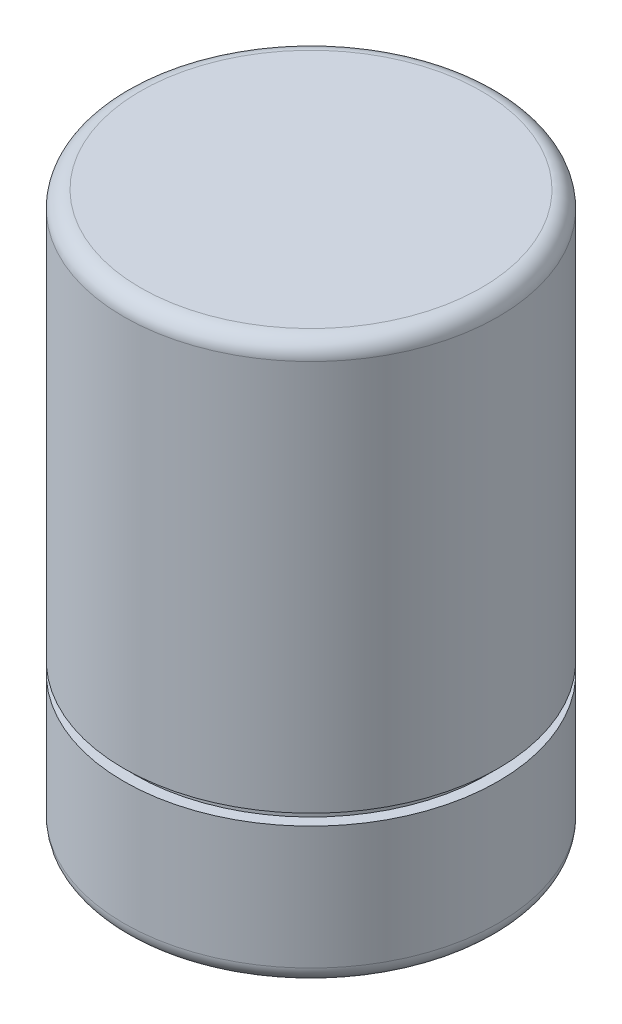
ISO-10303-21;
HEADER;
FILE_DESCRIPTION(('STEP AP214'),'2;1');
FILE_NAME('part.step','',(''),(''),'','','');
FILE_SCHEMA(('AUTOMOTIVE_DESIGN { 1 0 10303 214 1 1 1 1 }'));
ENDSEC;
DATA;
#1=APPLICATION_CONTEXT('core data for automotive mechanical design processes');
#2=APPLICATION_PROTOCOL_DEFINITION('international standard','automotive_design',2000,#1);
#3=PRODUCT_CONTEXT('',#1,'mechanical');
#4=PRODUCT('Part','Part','',(#3));
#5=PRODUCT_RELATED_PRODUCT_CATEGORY('part','',(#4));
#6=PRODUCT_DEFINITION_FORMATION('','',#4);
#7=PRODUCT_DEFINITION_CONTEXT('part definition',#1,'design');
#8=PRODUCT_DEFINITION('design','',#6,#7);
#9=PRODUCT_DEFINITION_SHAPE('','',#8);
#10=(LENGTH_UNIT() NAMED_UNIT(*) SI_UNIT(.MILLI.,.METRE.));
#11=(NAMED_UNIT(*) PLANE_ANGLE_UNIT() SI_UNIT($,.RADIAN.));
#12=(NAMED_UNIT(*) SI_UNIT($,.STERADIAN.) SOLID_ANGLE_UNIT());
#13=UNCERTAINTY_MEASURE_WITH_UNIT(LENGTH_MEASURE(1.E-05),#10,'distance_accuracy_value','');
#14=(GEOMETRIC_REPRESENTATION_CONTEXT(3) GLOBAL_UNCERTAINTY_ASSIGNED_CONTEXT((#13)) GLOBAL_UNIT_ASSIGNED_CONTEXT((#10,
#11,#12)) REPRESENTATION_CONTEXT('',''));
#15=CARTESIAN_POINT('',(0.,0.,0.));
#16=DIRECTION('',(0.,0.,1.));
#17=DIRECTION('',(1.,0.,0.));
#18=AXIS2_PLACEMENT_3D('',#15,#16,#17);
#19=CARTESIAN_POINT('',(0.,0.,-33.5));
#20=DIRECTION('',(0.,-1.,0.));
#21=DIRECTION('',(0.,0.,-1.));
#22=AXIS2_PLACEMENT_3D('',#19,#20,#21);
#23=PLANE('',#22);
#24=CARTESIAN_POINT('',(0.,0.,0.));
#25=DIRECTION('',(0.,-1.,0.));
#26=DIRECTION('',(0.,0.,-1.));
#27=AXIS2_PLACEMENT_3D('',#24,#25,#26);
#28=CIRCLE('',#27,30.5);
#29=CARTESIAN_POINT('',(0.,0.,-30.5));
#30=VERTEX_POINT('',#29);
#31=EDGE_CURVE('E44',#30,#30,#28,.T.);
#32=ORIENTED_EDGE('',*,*,#31,.T.);
#33=EDGE_LOOP('',(#32));
#34=FACE_BOUND('',#33,.T.);
#35=ADVANCED_FACE('F36',(#34),#23,.T.);
#36=CARTESIAN_POINT('',(0.,100.,0.));
#37=DIRECTION('',(0.,1.,0.));
#38=DIRECTION('',(0.,0.,1.));
#39=AXIS2_PLACEMENT_3D('',#36,#37,#38);
#40=PLANE('',#39);
#41=CARTESIAN_POINT('',(0.,100.,0.));
#42=DIRECTION('',(0.,1.,0.));
#43=DIRECTION('',(0.,0.,1.));
#44=AXIS2_PLACEMENT_3D('',#41,#42,#43);
#45=CIRCLE('',#44,30.5);
#46=CARTESIAN_POINT('',(0.,100.,30.5));
#47=VERTEX_POINT('',#46);
#48=EDGE_CURVE('E49',#47,#47,#45,.T.);
#49=ORIENTED_EDGE('',*,*,#48,.T.);
#50=EDGE_LOOP('',(#49));
#51=FACE_BOUND('',#50,.T.);
#52=ADVANCED_FACE('F95',(#51),#40,.T.);
#53=CARTESIAN_POINT('',(0.,0.,0.));
#54=DIRECTION('',(0.,-1.,0.));
#55=DIRECTION('',(0.,0.,-1.));
#56=AXIS2_PLACEMENT_3D('',#53,#54,#55);
#57=CYLINDRICAL_SURFACE('',#56,33.5);
#58=CARTESIAN_POINT('',(0.,97.,0.));
#59=DIRECTION('',(0.,1.,0.));
#60=DIRECTION('',(0.,0.,1.));
#61=AXIS2_PLACEMENT_3D('',#58,#59,#60);
#62=CIRCLE('',#61,33.5);
#63=CARTESIAN_POINT('',(0.,97.,33.5));
#64=VERTEX_POINT('',#63);
#65=EDGE_CURVE('E54',#64,#64,#62,.F.);
#66=ORIENTED_EDGE('',*,*,#65,.T.);
#67=EDGE_LOOP('',(#66));
#68=FACE_BOUND('',#67,.T.);
#69=CARTESIAN_POINT('',(0.,27.,0.));
#70=DIRECTION('',(0.,-1.,0.));
#71=DIRECTION('',(0.,0.,-1.));
#72=AXIS2_PLACEMENT_3D('',#69,#70,#71);
#73=CIRCLE('',#72,33.5);
#74=CARTESIAN_POINT('',(0.,27.,-33.5));
#75=VERTEX_POINT('',#74);
#76=EDGE_CURVE('E60',#75,#75,#73,.T.);
#77=ORIENTED_EDGE('',*,*,#76,.F.);
#78=EDGE_LOOP('',(#77));
#79=FACE_BOUND('',#78,.T.);
#80=ADVANCED_FACE('F101',(#68,#79),#57,.T.);
#81=CARTESIAN_POINT('',(0.,27.,-33.5));
#82=DIRECTION('',(0.,-1.,0.));
#83=DIRECTION('',(0.,0.,-1.));
#84=AXIS2_PLACEMENT_3D('',#81,#82,#83);
#85=PLANE('',#84);
#86=ORIENTED_EDGE('',*,*,#76,.T.);
#87=EDGE_LOOP('',(#86));
#88=FACE_BOUND('',#87,.T.);
#89=CARTESIAN_POINT('',(0.,27.,0.));
#90=DIRECTION('',(0.,-1.,0.));
#91=DIRECTION('',(0.,0.,-1.));
#92=AXIS2_PLACEMENT_3D('',#89,#90,#91);
#93=CIRCLE('',#92,31.5);
#94=CARTESIAN_POINT('',(0.,27.,-31.5));
#95=VERTEX_POINT('',#94);
#96=EDGE_CURVE('E64',#95,#95,#93,.T.);
#97=ORIENTED_EDGE('',*,*,#96,.F.);
#98=EDGE_LOOP('',(#97));
#99=FACE_BOUND('',#98,.T.);
#100=ADVANCED_FACE('F91',(#88,#99),#85,.T.);
#101=CARTESIAN_POINT('',(0.,0.,0.));
#102=DIRECTION('',(0.,-1.,0.));
#103=DIRECTION('',(0.,0.,-1.));
#104=AXIS2_PLACEMENT_3D('',#101,#102,#103);
#105=CYLINDRICAL_SURFACE('',#104,31.5);
#106=ORIENTED_EDGE('',*,*,#96,.T.);
#107=EDGE_LOOP('',(#106));
#108=FACE_BOUND('',#107,.T.);
#109=CARTESIAN_POINT('',(0.,25.,0.));
#110=DIRECTION('',(0.,-1.,0.));
#111=DIRECTION('',(0.,0.,-1.));
#112=AXIS2_PLACEMENT_3D('',#109,#110,#111);
#113=CIRCLE('',#112,31.5);
#114=CARTESIAN_POINT('',(0.,25.,-31.5));
#115=VERTEX_POINT('',#114);
#116=EDGE_CURVE('E68',#115,#115,#113,.T.);
#117=ORIENTED_EDGE('',*,*,#116,.F.);
#118=EDGE_LOOP('',(#117));
#119=FACE_BOUND('',#118,.T.);
#120=ADVANCED_FACE('F81',(#108,#119),#105,.T.);
#121=CARTESIAN_POINT('',(0.,25.,-31.5));
#122=DIRECTION('',(0.,1.,0.));
#123=DIRECTION('',(0.,0.,1.));
#124=AXIS2_PLACEMENT_3D('',#121,#122,#123);
#125=PLANE('',#124);
#126=ORIENTED_EDGE('',*,*,#116,.T.);
#127=EDGE_LOOP('',(#126));
#128=FACE_BOUND('',#127,.T.);
#129=CARTESIAN_POINT('',(0.,25.,0.));
#130=DIRECTION('',(0.,-1.,0.));
#131=DIRECTION('',(0.,0.,-1.));
#132=AXIS2_PLACEMENT_3D('',#129,#130,#131);
#133=CIRCLE('',#132,33.5);
#134=CARTESIAN_POINT('',(0.,25.,-33.5));
#135=VERTEX_POINT('',#134);
#136=EDGE_CURVE('E72',#135,#135,#133,.T.);
#137=ORIENTED_EDGE('',*,*,#136,.F.);
#138=EDGE_LOOP('',(#137));
#139=FACE_BOUND('',#138,.T.);
#140=ADVANCED_FACE('F79',(#128,#139),#125,.T.);
#141=CARTESIAN_POINT('',(0.,0.,0.));
#142=DIRECTION('',(0.,-1.,0.));
#143=DIRECTION('',(0.,0.,-1.));
#144=AXIS2_PLACEMENT_3D('',#141,#142,#143);
#145=CYLINDRICAL_SURFACE('',#144,33.5);
#146=CARTESIAN_POINT('',(0.,3.,0.));
#147=DIRECTION('',(0.,-1.,0.));
#148=DIRECTION('',(0.,0.,-1.));
#149=AXIS2_PLACEMENT_3D('',#146,#147,#148);
#150=CIRCLE('',#149,33.5);
#151=CARTESIAN_POINT('',(0.,3.,-33.5));
#152=VERTEX_POINT('',#151);
#153=EDGE_CURVE('E10',#152,#152,#150,.F.);
#154=ORIENTED_EDGE('',*,*,#153,.T.);
#155=EDGE_LOOP('',(#154));
#156=FACE_BOUND('',#155,.T.);
#157=ORIENTED_EDGE('',*,*,#136,.T.);
#158=EDGE_LOOP('',(#157));
#159=FACE_BOUND('',#158,.T.);
#160=ADVANCED_FACE('F77',(#156,#159),#145,.T.);
#161=CARTESIAN_POINT('',(0.,97.,0.));
#162=DIRECTION('',(0.,1.,0.));
#163=DIRECTION('',(0.,0.,1.));
#164=AXIS2_PLACEMENT_3D('',#161,#162,#163);
#165=TOROIDAL_SURFACE('',#164,30.5,3.);
#166=ORIENTED_EDGE('',*,*,#48,.F.);
#167=EDGE_LOOP('',(#166));
#168=FACE_BOUND('',#167,.T.);
#169=ORIENTED_EDGE('',*,*,#65,.F.);
#170=EDGE_LOOP('',(#169));
#171=FACE_BOUND('',#170,.T.);
#172=ADVANCED_FACE('F89',(#168,#171),#165,.T.);
#173=CARTESIAN_POINT('',(0.,3.,0.));
#174=DIRECTION('',(0.,-1.,0.));
#175=DIRECTION('',(0.,0.,-1.));
#176=AXIS2_PLACEMENT_3D('',#173,#174,#175);
#177=TOROIDAL_SURFACE('',#176,30.5,3.);
#178=ORIENTED_EDGE('',*,*,#153,.F.);
#179=EDGE_LOOP('',(#178));
#180=FACE_BOUND('',#179,.T.);
#181=ORIENTED_EDGE('',*,*,#31,.F.);
#182=EDGE_LOOP('',(#181));
#183=FACE_BOUND('',#182,.T.);
#184=ADVANCED_FACE('F38',(#180,#183),#177,.T.);
#185=CLOSED_SHELL('',(#35,#52,#80,#100,#120,#140,#160,#172,#184));
#186=MANIFOLD_SOLID_BREP('B2',#185);
#187=ADVANCED_BREP_SHAPE_REPRESENTATION('',(#18,#186),#14);
#188=SHAPE_DEFINITION_REPRESENTATION(#9,#187);
ENDSEC;
END-ISO-10303-21;
